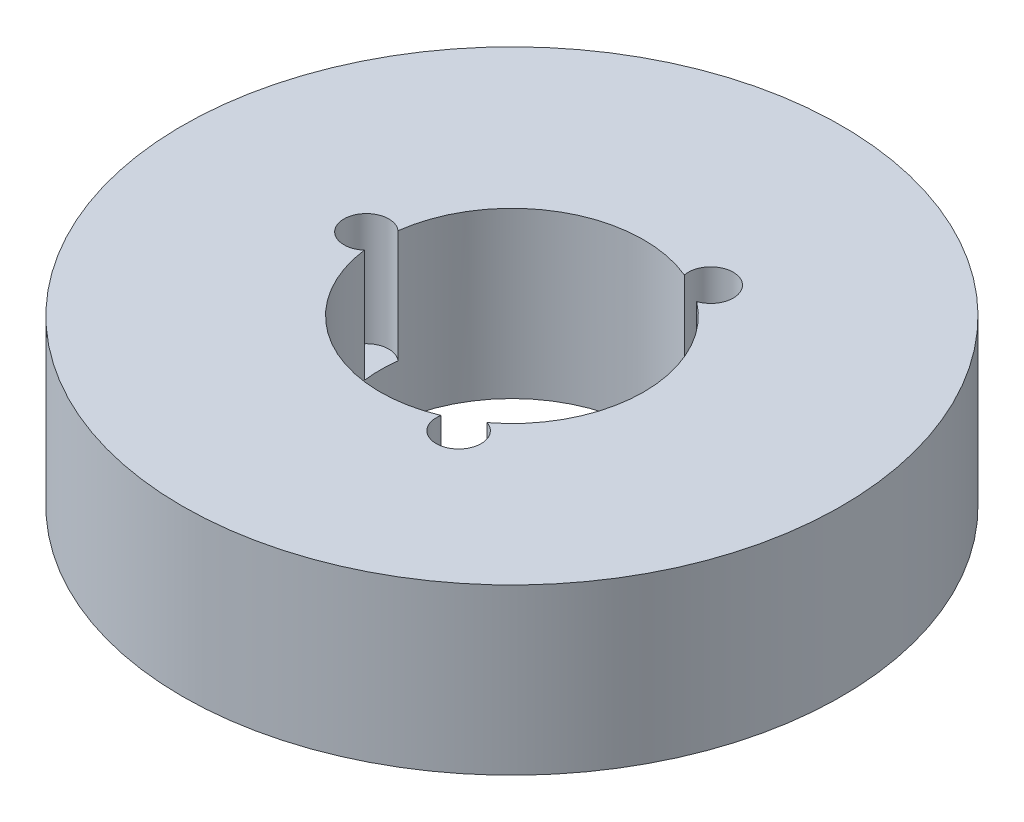
ISO-10303-21;
HEADER;
FILE_DESCRIPTION(('STEP AP214'),'2;1');
FILE_NAME('part.step','',(''),(''),'','','');
FILE_SCHEMA(('AUTOMOTIVE_DESIGN { 1 0 10303 214 1 1 1 1 }'));
ENDSEC;
DATA;
#1=APPLICATION_CONTEXT('core data for automotive mechanical design processes');
#2=APPLICATION_PROTOCOL_DEFINITION('international standard','automotive_design',2000,#1);
#3=PRODUCT_CONTEXT('',#1,'mechanical');
#4=PRODUCT('Part','Part','',(#3));
#5=PRODUCT_RELATED_PRODUCT_CATEGORY('part','',(#4));
#6=PRODUCT_DEFINITION_FORMATION('','',#4);
#7=PRODUCT_DEFINITION_CONTEXT('part definition',#1,'design');
#8=PRODUCT_DEFINITION('design','',#6,#7);
#9=PRODUCT_DEFINITION_SHAPE('','',#8);
#10=(LENGTH_UNIT() NAMED_UNIT(*) SI_UNIT(.MILLI.,.METRE.));
#11=(NAMED_UNIT(*) PLANE_ANGLE_UNIT() SI_UNIT($,.RADIAN.));
#12=(NAMED_UNIT(*) SI_UNIT($,.STERADIAN.) SOLID_ANGLE_UNIT());
#13=UNCERTAINTY_MEASURE_WITH_UNIT(LENGTH_MEASURE(1.E-05),#10,'distance_accuracy_value','');
#14=(GEOMETRIC_REPRESENTATION_CONTEXT(3) GLOBAL_UNCERTAINTY_ASSIGNED_CONTEXT((#13)) GLOBAL_UNIT_ASSIGNED_CONTEXT((#10,
#11,#12)) REPRESENTATION_CONTEXT('',''));
#15=CARTESIAN_POINT('',(0.,0.,0.));
#16=DIRECTION('',(0.,0.,1.));
#17=DIRECTION('',(1.,0.,0.));
#18=AXIS2_PLACEMENT_3D('',#15,#16,#17);
#19=CARTESIAN_POINT('',(0.,25.,0.));
#20=DIRECTION('',(0.,-1.,0.));
#21=DIRECTION('',(0.,0.,-1.));
#22=AXIS2_PLACEMENT_3D('',#19,#20,#21);
#23=CYLINDRICAL_SURFACE('',#22,50.);
#24=CARTESIAN_POINT('',(0.,25.,0.));
#25=DIRECTION('',(0.,1.,0.));
#26=DIRECTION('',(0.,0.,1.));
#27=AXIS2_PLACEMENT_3D('',#24,#25,#26);
#28=CIRCLE('',#27,50.);
#29=CARTESIAN_POINT('',(0.,25.,50.));
#30=VERTEX_POINT('',#29);
#31=EDGE_CURVE('E126',#30,#30,#28,.T.);
#32=ORIENTED_EDGE('',*,*,#31,.F.);
#33=EDGE_LOOP('',(#32));
#34=FACE_BOUND('',#33,.T.);
#35=CARTESIAN_POINT('',(0.,0.,0.));
#36=DIRECTION('',(0.,1.,0.));
#37=DIRECTION('',(0.,0.,1.));
#38=AXIS2_PLACEMENT_3D('',#35,#36,#37);
#39=CIRCLE('',#38,50.);
#40=CARTESIAN_POINT('',(0.,0.,50.));
#41=VERTEX_POINT('',#40);
#42=EDGE_CURVE('E124',#41,#41,#39,.T.);
#43=ORIENTED_EDGE('',*,*,#42,.T.);
#44=EDGE_LOOP('',(#43));
#45=FACE_BOUND('',#44,.T.);
#46=ADVANCED_FACE('F39',(#34,#45),#23,.T.);
#47=CARTESIAN_POINT('',(0.,25.,0.));
#48=DIRECTION('',(0.,1.,0.));
#49=DIRECTION('',(0.,0.,1.));
#50=AXIS2_PLACEMENT_3D('',#47,#48,#49);
#51=PLANE('',#50);
#52=CARTESIAN_POINT('',(11.0419498911036,25.,19.1252182260209));
#53=DIRECTION('',(0.,1.,0.));
#54=DIRECTION('',(0.866025403784436,0.,-0.500000000000004));
#55=AXIS2_PLACEMENT_3D('',#52,#53,#54);
#56=CIRCLE('',#55,3.40634226933071);
#57=CARTESIAN_POINT('',(7.70166507491555,25.,18.4576367683901));
#58=VERTEX_POINT('',#57);
#59=CARTESIAN_POINT('',(12.1339497977939,25.,15.8986559905112));
#60=VERTEX_POINT('',#59);
#61=EDGE_CURVE('E147',#58,#60,#56,.T.);
#62=ORIENTED_EDGE('',*,*,#61,.F.);
#63=CARTESIAN_POINT('',(0.,25.,0.));
#64=DIRECTION('',(0.,1.,0.));
#65=DIRECTION('',(0.,0.,1.));
#66=AXIS2_PLACEMENT_3D('',#63,#64,#65);
#67=CIRCLE('',#66,20.);
#68=CARTESIAN_POINT('',(-19.8356148727093,25.,2.5589807778789));
#69=VERTEX_POINT('',#68);
#70=EDGE_CURVE('E118',#69,#58,#67,.T.);
#71=ORIENTED_EDGE('',*,*,#70,.F.);
#72=CARTESIAN_POINT('',(-22.0838997822071,25.,0.));
#73=DIRECTION('',(0.,1.,0.));
#74=DIRECTION('',(0.,0.,1.));
#75=AXIS2_PLACEMENT_3D('',#72,#73,#74);
#76=CIRCLE('',#75,3.40634226933071);
#77=CARTESIAN_POINT('',(-19.8356148727093,25.,-2.5589807778789));
#78=VERTEX_POINT('',#77);
#79=EDGE_CURVE('E113',#78,#69,#76,.T.);
#80=ORIENTED_EDGE('',*,*,#79,.F.);
#81=CARTESIAN_POINT('',(7.70166507491529,25.,-18.4576367683902));
#82=VERTEX_POINT('',#81);
#83=EDGE_CURVE('E106',#82,#78,#67,.T.);
#84=ORIENTED_EDGE('',*,*,#83,.F.);
#85=CARTESIAN_POINT('',(11.0419498911034,25.,-19.1252182260211));
#86=DIRECTION('',(0.,1.,0.));
#87=DIRECTION('',(-0.866025403784443,0.,-0.499999999999992));
#88=AXIS2_PLACEMENT_3D('',#85,#86,#87);
#89=CIRCLE('',#88,3.40634226933071);
#90=CARTESIAN_POINT('',(12.1339497977937,25.,-15.8986559905114));
#91=VERTEX_POINT('',#90);
#92=EDGE_CURVE('E90',#91,#82,#89,.T.);
#93=ORIENTED_EDGE('',*,*,#92,.F.);
#94=EDGE_CURVE('E116',#60,#91,#67,.T.);
#95=ORIENTED_EDGE('',*,*,#94,.F.);
#96=EDGE_LOOP('',(#62,#71,#80,#84,#93,#95));
#97=FACE_BOUND('',#96,.T.);
#98=ORIENTED_EDGE('',*,*,#31,.T.);
#99=EDGE_LOOP('',(#98));
#100=FACE_BOUND('',#99,.T.);
#101=ADVANCED_FACE('F115',(#97,#100),#51,.T.);
#102=CARTESIAN_POINT('',(0.,0.,0.));
#103=DIRECTION('',(0.,1.,0.));
#104=DIRECTION('',(0.,0.,1.));
#105=AXIS2_PLACEMENT_3D('',#102,#103,#104);
#106=PLANE('',#105);
#107=CARTESIAN_POINT('',(0.,0.,0.));
#108=DIRECTION('',(0.,1.,0.));
#109=DIRECTION('',(0.,0.,1.));
#110=AXIS2_PLACEMENT_3D('',#107,#108,#109);
#111=CIRCLE('',#110,20.);
#112=CARTESIAN_POINT('',(0.,0.,20.));
#113=VERTEX_POINT('',#112);
#114=EDGE_CURVE('E120',#113,#113,#111,.T.);
#115=ORIENTED_EDGE('',*,*,#114,.T.);
#116=EDGE_LOOP('',(#115));
#117=FACE_BOUND('',#116,.T.);
#118=ORIENTED_EDGE('',*,*,#42,.F.);
#119=EDGE_LOOP('',(#118));
#120=FACE_BOUND('',#119,.T.);
#121=ADVANCED_FACE('F164',(#117,#120),#106,.F.);
#122=CARTESIAN_POINT('',(0.,25.,0.));
#123=DIRECTION('',(0.,-1.,0.));
#124=DIRECTION('',(0.,0.,-1.));
#125=AXIS2_PLACEMENT_3D('',#122,#123,#124);
#126=CYLINDRICAL_SURFACE('',#125,20.);
#127=DIRECTION('',(0.,1.,0.));
#128=VECTOR('',#127,1.);
#129=CARTESIAN_POINT('',(7.70166507491555,16.4474204533998,18.4576367683901));
#130=LINE('',#129,#128);
#131=CARTESIAN_POINT('',(7.70166507491555,7.89484090679965,18.4576367683901));
#132=VERTEX_POINT('',#131);
#133=EDGE_CURVE('E11',#132,#58,#130,.T.);
#134=ORIENTED_EDGE('',*,*,#133,.F.);
#135=CARTESIAN_POINT('',(0.,7.89484090679965,0.));
#136=DIRECTION('',(0.,1.,0.));
#137=DIRECTION('',(0.,0.,1.));
#138=AXIS2_PLACEMENT_3D('',#135,#136,#137);
#139=CIRCLE('',#138,20.);
#140=CARTESIAN_POINT('',(12.1339497977939,7.89484090679965,15.8986559905112));
#141=VERTEX_POINT('',#140);
#142=EDGE_CURVE('E144',#132,#141,#139,.T.);
#143=ORIENTED_EDGE('',*,*,#142,.T.);
#144=DIRECTION('',(0.,1.,0.));
#145=VECTOR('',#144,1.);
#146=CARTESIAN_POINT('',(12.1339497977939,16.4474204533998,15.8986559905112));
#147=LINE('',#146,#145);
#148=EDGE_CURVE('E46',#60,#141,#147,.F.);
#149=ORIENTED_EDGE('',*,*,#148,.F.);
#150=ORIENTED_EDGE('',*,*,#94,.T.);
#151=DIRECTION('',(0.,1.,0.));
#152=VECTOR('',#151,1.);
#153=CARTESIAN_POINT('',(12.1339497977937,16.4474204533998,-15.8986559905114));
#154=LINE('',#153,#152);
#155=CARTESIAN_POINT('',(12.1339497977937,7.89484090679965,-15.8986559905114));
#156=VERTEX_POINT('',#155);
#157=EDGE_CURVE('E92',#156,#91,#154,.T.);
#158=ORIENTED_EDGE('',*,*,#157,.F.);
#159=CARTESIAN_POINT('',(0.,7.89484090679965,0.));
#160=DIRECTION('',(0.,1.,0.));
#161=DIRECTION('',(0.,0.,1.));
#162=AXIS2_PLACEMENT_3D('',#159,#160,#161);
#163=CIRCLE('',#162,20.);
#164=CARTESIAN_POINT('',(7.70166507491529,7.89484090679965,-18.4576367683902));
#165=VERTEX_POINT('',#164);
#166=EDGE_CURVE('E107',#156,#165,#163,.T.);
#167=ORIENTED_EDGE('',*,*,#166,.T.);
#168=DIRECTION('',(0.,1.,0.));
#169=VECTOR('',#168,1.);
#170=CARTESIAN_POINT('',(7.70166507491529,16.4474204533998,-18.4576367683902));
#171=LINE('',#170,#169);
#172=EDGE_CURVE('E95',#82,#165,#171,.F.);
#173=ORIENTED_EDGE('',*,*,#172,.F.);
#174=ORIENTED_EDGE('',*,*,#83,.T.);
#175=DIRECTION('',(0.,1.,0.));
#176=VECTOR('',#175,1.);
#177=CARTESIAN_POINT('',(-19.8356148727093,16.4474204533998,-2.5589807778789));
#178=LINE('',#177,#176);
#179=CARTESIAN_POINT('',(-19.8356148727093,7.89484090679965,-2.5589807778789));
#180=VERTEX_POINT('',#179);
#181=EDGE_CURVE('E143',#180,#78,#178,.T.);
#182=ORIENTED_EDGE('',*,*,#181,.F.);
#183=CARTESIAN_POINT('',(0.,7.89484090679965,0.));
#184=DIRECTION('',(0.,1.,0.));
#185=DIRECTION('',(0.,0.,1.));
#186=AXIS2_PLACEMENT_3D('',#183,#184,#185);
#187=CIRCLE('',#186,20.);
#188=CARTESIAN_POINT('',(-19.8356148727093,7.89484090679965,2.5589807778789));
#189=VERTEX_POINT('',#188);
#190=EDGE_CURVE('E132',#180,#189,#187,.T.);
#191=ORIENTED_EDGE('',*,*,#190,.T.);
#192=DIRECTION('',(0.,1.,0.));
#193=VECTOR('',#192,1.);
#194=CARTESIAN_POINT('',(-19.8356148727093,16.4474204533998,2.5589807778789));
#195=LINE('',#194,#193);
#196=EDGE_CURVE('E137',#69,#189,#195,.F.);
#197=ORIENTED_EDGE('',*,*,#196,.F.);
#198=ORIENTED_EDGE('',*,*,#70,.T.);
#199=EDGE_LOOP('',(#134,#143,#149,#150,#158,#167,#173,#174,#182,#191,#197,#198));
#200=FACE_BOUND('',#199,.T.);
#201=ORIENTED_EDGE('',*,*,#114,.F.);
#202=EDGE_LOOP('',(#201));
#203=FACE_BOUND('',#202,.T.);
#204=ADVANCED_FACE('F103',(#200,#203),#126,.F.);
#205=CARTESIAN_POINT('',(-22.0838997822071,7.89484090679965,0.));
#206=DIRECTION('',(0.,1.,0.));
#207=DIRECTION('',(0.,0.,1.));
#208=AXIS2_PLACEMENT_3D('',#205,#206,#207);
#209=CYLINDRICAL_SURFACE('',#208,3.40634226933071);
#210=ORIENTED_EDGE('',*,*,#181,.T.);
#211=ORIENTED_EDGE('',*,*,#79,.T.);
#212=ORIENTED_EDGE('',*,*,#196,.T.);
#213=CARTESIAN_POINT('',(-22.0838997822071,7.89484090679965,0.));
#214=DIRECTION('',(0.,1.,0.));
#215=DIRECTION('',(0.,0.,1.));
#216=AXIS2_PLACEMENT_3D('',#213,#214,#215);
#217=CIRCLE('',#216,3.40634226933071);
#218=EDGE_CURVE('E121',#180,#189,#217,.T.);
#219=ORIENTED_EDGE('',*,*,#218,.F.);
#220=EDGE_LOOP('',(#210,#211,#212,#219));
#221=FACE_BOUND('',#220,.T.);
#222=ADVANCED_FACE('F174',(#221),#209,.F.);
#223=CARTESIAN_POINT('',(-22.0838997822071,7.89484090679965,0.));
#224=DIRECTION('',(0.,1.,0.));
#225=DIRECTION('',(0.,0.,1.));
#226=AXIS2_PLACEMENT_3D('',#223,#224,#225);
#227=PLANE('',#226);
#228=ORIENTED_EDGE('',*,*,#218,.T.);
#229=ORIENTED_EDGE('',*,*,#190,.F.);
#230=EDGE_LOOP('',(#228,#229));
#231=FACE_BOUND('',#230,.T.);
#232=ADVANCED_FACE('F177',(#231),#227,.T.);
#233=CARTESIAN_POINT('',(11.0419498911034,7.89484090679965,-19.1252182260211));
#234=DIRECTION('',(0.,1.,0.));
#235=DIRECTION('',(0.,0.,1.));
#236=AXIS2_PLACEMENT_3D('',#233,#234,#235);
#237=CYLINDRICAL_SURFACE('',#236,3.40634226933071);
#238=ORIENTED_EDGE('',*,*,#157,.T.);
#239=ORIENTED_EDGE('',*,*,#92,.T.);
#240=ORIENTED_EDGE('',*,*,#172,.T.);
#241=CARTESIAN_POINT('',(11.0419498911034,7.89484090679965,-19.1252182260211));
#242=DIRECTION('',(0.,1.,0.));
#243=DIRECTION('',(-0.866025403784443,0.,-0.499999999999992));
#244=AXIS2_PLACEMENT_3D('',#241,#242,#243);
#245=CIRCLE('',#244,3.40634226933071);
#246=EDGE_CURVE('E56',#156,#165,#245,.T.);
#247=ORIENTED_EDGE('',*,*,#246,.F.);
#248=EDGE_LOOP('',(#238,#239,#240,#247));
#249=FACE_BOUND('',#248,.T.);
#250=ADVANCED_FACE('F93',(#249),#237,.F.);
#251=CARTESIAN_POINT('',(11.0419498911034,7.89484090679965,-19.1252182260211));
#252=DIRECTION('',(0.,1.,0.));
#253=DIRECTION('',(-0.866025403784443,0.,-0.499999999999992));
#254=AXIS2_PLACEMENT_3D('',#251,#252,#253);
#255=PLANE('',#254);
#256=ORIENTED_EDGE('',*,*,#246,.T.);
#257=ORIENTED_EDGE('',*,*,#166,.F.);
#258=EDGE_LOOP('',(#256,#257));
#259=FACE_BOUND('',#258,.T.);
#260=ADVANCED_FACE('F160',(#259),#255,.T.);
#261=CARTESIAN_POINT('',(11.0419498911036,7.89484090679965,19.1252182260209));
#262=DIRECTION('',(0.,1.,0.));
#263=DIRECTION('',(0.,0.,1.));
#264=AXIS2_PLACEMENT_3D('',#261,#262,#263);
#265=CYLINDRICAL_SURFACE('',#264,3.40634226933071);
#266=ORIENTED_EDGE('',*,*,#133,.T.);
#267=ORIENTED_EDGE('',*,*,#61,.T.);
#268=ORIENTED_EDGE('',*,*,#148,.T.);
#269=CARTESIAN_POINT('',(11.0419498911036,7.89484090679965,19.1252182260209));
#270=DIRECTION('',(0.,1.,0.));
#271=DIRECTION('',(0.866025403784436,0.,-0.500000000000004));
#272=AXIS2_PLACEMENT_3D('',#269,#270,#271);
#273=CIRCLE('',#272,3.40634226933071);
#274=EDGE_CURVE('E55',#132,#141,#273,.T.);
#275=ORIENTED_EDGE('',*,*,#274,.F.);
#276=EDGE_LOOP('',(#266,#267,#268,#275));
#277=FACE_BOUND('',#276,.T.);
#278=ADVANCED_FACE('F149',(#277),#265,.F.);
#279=CARTESIAN_POINT('',(11.0419498911036,7.89484090679965,19.1252182260209));
#280=DIRECTION('',(0.,1.,0.));
#281=DIRECTION('',(0.866025403784436,0.,-0.500000000000004));
#282=AXIS2_PLACEMENT_3D('',#279,#280,#281);
#283=PLANE('',#282);
#284=ORIENTED_EDGE('',*,*,#274,.T.);
#285=ORIENTED_EDGE('',*,*,#142,.F.);
#286=EDGE_LOOP('',(#284,#285));
#287=FACE_BOUND('',#286,.T.);
#288=ADVANCED_FACE('F151',(#287),#283,.T.);
#289=CLOSED_SHELL('',(#46,#101,#121,#204,#222,#232,#250,#260,#278,#288));
#290=MANIFOLD_SOLID_BREP('B2',#289);
#291=ADVANCED_BREP_SHAPE_REPRESENTATION('',(#18,#290),#14);
#292=SHAPE_DEFINITION_REPRESENTATION(#9,#291);
ENDSEC;
END-ISO-10303-21;
